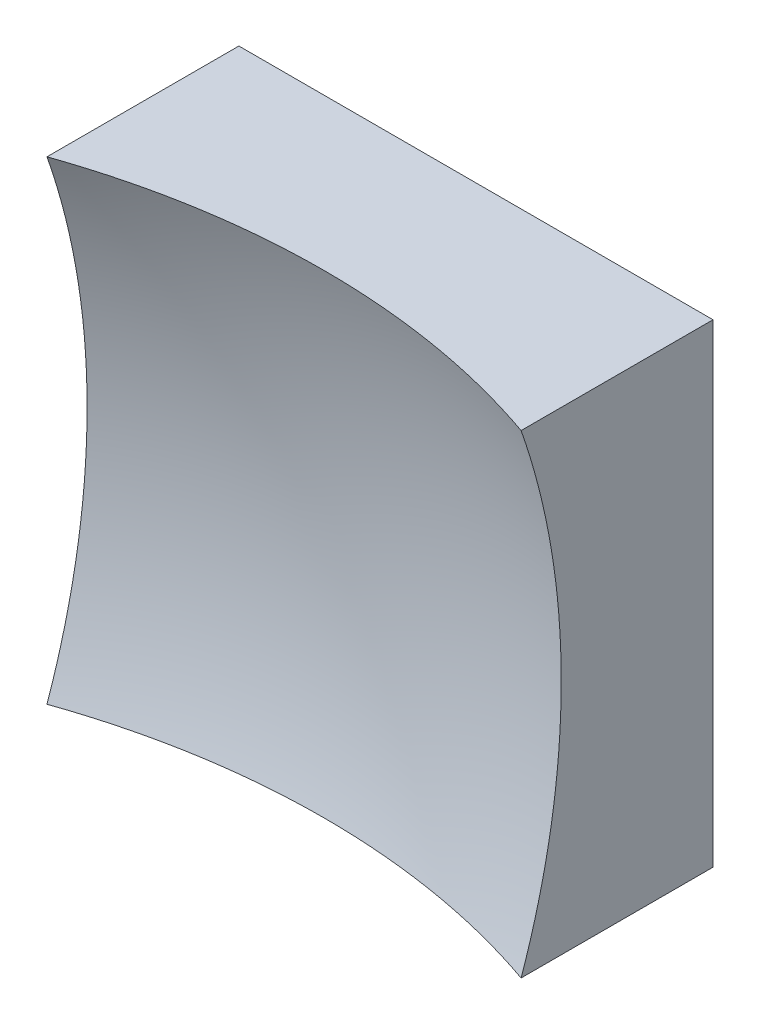
ISO-10303-21;
HEADER;
FILE_DESCRIPTION(('STEP AP214'),'2;1');
FILE_NAME('part.step','',(''),(''),'','','');
FILE_SCHEMA(('AUTOMOTIVE_DESIGN { 1 0 10303 214 1 1 1 1 }'));
ENDSEC;
DATA;
#1=APPLICATION_CONTEXT('core data for automotive mechanical design processes');
#2=APPLICATION_PROTOCOL_DEFINITION('international standard','automotive_design',2000,#1);
#3=PRODUCT_CONTEXT('',#1,'mechanical');
#4=PRODUCT('Part','Part','',(#3));
#5=PRODUCT_RELATED_PRODUCT_CATEGORY('part','',(#4));
#6=PRODUCT_DEFINITION_FORMATION('','',#4);
#7=PRODUCT_DEFINITION_CONTEXT('part definition',#1,'design');
#8=PRODUCT_DEFINITION('design','',#6,#7);
#9=PRODUCT_DEFINITION_SHAPE('','',#8);
#10=(LENGTH_UNIT() NAMED_UNIT(*) SI_UNIT(.MILLI.,.METRE.));
#11=(NAMED_UNIT(*) PLANE_ANGLE_UNIT() SI_UNIT($,.RADIAN.));
#12=(NAMED_UNIT(*) SI_UNIT($,.STERADIAN.) SOLID_ANGLE_UNIT());
#13=UNCERTAINTY_MEASURE_WITH_UNIT(LENGTH_MEASURE(1.E-05),#10,'distance_accuracy_value','');
#14=(GEOMETRIC_REPRESENTATION_CONTEXT(3) GLOBAL_UNCERTAINTY_ASSIGNED_CONTEXT((#13)) GLOBAL_UNIT_ASSIGNED_CONTEXT((#10,
#11,#12)) REPRESENTATION_CONTEXT('',''));
#15=CARTESIAN_POINT('',(0.,0.,0.));
#16=DIRECTION('',(0.,0.,1.));
#17=DIRECTION('',(1.,0.,0.));
#18=AXIS2_PLACEMENT_3D('',#15,#16,#17);
#19=CARTESIAN_POINT('',(-12.5,12.5,20.));
#20=DIRECTION('',(0.,1.,0.));
#21=DIRECTION('',(0.,0.,1.));
#22=AXIS2_PLACEMENT_3D('',#19,#20,#21);
#23=PLANE('',#22);
#24=CARTESIAN_POINT('',(0.,12.5,46.));
#25=DIRECTION('',(0.,1.,0.));
#26=DIRECTION('',(0.,0.,1.));
#27=AXIS2_PLACEMENT_3D('',#24,#25,#26);
#28=CIRCLE('',#27,37.9967103839267);
#29=CARTESIAN_POINT('',(12.5,12.5,10.1182497639817));
#30=VERTEX_POINT('',#29);
#31=CARTESIAN_POINT('',(-12.5,12.5,10.1182497639817));
#32=VERTEX_POINT('',#31);
#33=EDGE_CURVE('E83',#30,#32,#28,.T.);
#34=ORIENTED_EDGE('',*,*,#33,.F.);
#35=DIRECTION('',(0.,0.,-1.));
#36=VECTOR('',#35,1.);
#37=CARTESIAN_POINT('',(12.5,12.5,20.));
#38=LINE('',#37,#36);
#39=CARTESIAN_POINT('',(12.5,12.5,0.));
#40=VERTEX_POINT('',#39);
#41=EDGE_CURVE('E89',#30,#40,#38,.T.);
#42=ORIENTED_EDGE('',*,*,#41,.T.);
#43=DIRECTION('',(1.,0.,0.));
#44=VECTOR('',#43,1.);
#45=CARTESIAN_POINT('',(-12.5,12.5,0.));
#46=LINE('',#45,#44);
#47=CARTESIAN_POINT('',(-12.5,12.5,0.));
#48=VERTEX_POINT('',#47);
#49=EDGE_CURVE('E92',#48,#40,#46,.T.);
#50=ORIENTED_EDGE('',*,*,#49,.F.);
#51=DIRECTION('',(0.,0.,-1.));
#52=VECTOR('',#51,1.);
#53=CARTESIAN_POINT('',(-12.5,12.5,20.));
#54=LINE('',#53,#52);
#55=EDGE_CURVE('E51',#32,#48,#54,.T.);
#56=ORIENTED_EDGE('',*,*,#55,.F.);
#57=EDGE_LOOP('',(#34,#42,#50,#56));
#58=FACE_BOUND('',#57,.T.);
#59=ADVANCED_FACE('F43',(#58),#23,.T.);
#60=CARTESIAN_POINT('',(-12.5,12.5,20.));
#61=DIRECTION('',(1.,0.,0.));
#62=DIRECTION('',(0.,1.,0.));
#63=AXIS2_PLACEMENT_3D('',#60,#61,#62);
#64=PLANE('',#63);
#65=DIRECTION('',(0.,0.,-1.));
#66=VECTOR('',#65,1.);
#67=CARTESIAN_POINT('',(-12.5,-12.5,20.));
#68=LINE('',#67,#66);
#69=CARTESIAN_POINT('',(-12.5,-12.5,10.1182497639817));
#70=VERTEX_POINT('',#69);
#71=CARTESIAN_POINT('',(-12.5,-12.5,0.));
#72=VERTEX_POINT('',#71);
#73=EDGE_CURVE('E104',#70,#72,#68,.T.);
#74=ORIENTED_EDGE('',*,*,#73,.F.);
#75=CARTESIAN_POINT('',(-12.5,0.,46.));
#76=DIRECTION('',(1.,0.,0.));
#77=DIRECTION('',(0.,1.,0.));
#78=AXIS2_PLACEMENT_3D('',#75,#76,#77);
#79=CIRCLE('',#78,37.9967103839267);
#80=EDGE_CURVE('E93',#70,#32,#79,.T.);
#81=ORIENTED_EDGE('',*,*,#80,.T.);
#82=ORIENTED_EDGE('',*,*,#55,.T.);
#83=DIRECTION('',(0.,-1.,0.));
#84=VECTOR('',#83,1.);
#85=CARTESIAN_POINT('',(-12.5,12.5,0.));
#86=LINE('',#85,#84);
#87=EDGE_CURVE('E101',#48,#72,#86,.T.);
#88=ORIENTED_EDGE('',*,*,#87,.T.);
#89=EDGE_LOOP('',(#74,#81,#82,#88));
#90=FACE_BOUND('',#89,.T.);
#91=ADVANCED_FACE('F126',(#90),#64,.F.);
#92=CARTESIAN_POINT('',(-12.5,-12.5,20.));
#93=DIRECTION('',(0.,1.,0.));
#94=DIRECTION('',(0.,0.,1.));
#95=AXIS2_PLACEMENT_3D('',#92,#93,#94);
#96=PLANE('',#95);
#97=DIRECTION('',(0.,0.,-1.));
#98=VECTOR('',#97,1.);
#99=CARTESIAN_POINT('',(12.5,-12.5,20.));
#100=LINE('',#99,#98);
#101=CARTESIAN_POINT('',(12.5,-12.5,10.1182497639817));
#102=VERTEX_POINT('',#101);
#103=CARTESIAN_POINT('',(12.5,-12.5,0.));
#104=VERTEX_POINT('',#103);
#105=EDGE_CURVE('E100',#102,#104,#100,.T.);
#106=ORIENTED_EDGE('',*,*,#105,.F.);
#107=CARTESIAN_POINT('',(0.,-12.5,46.));
#108=DIRECTION('',(0.,1.,0.));
#109=DIRECTION('',(0.,0.,1.));
#110=AXIS2_PLACEMENT_3D('',#107,#108,#109);
#111=CIRCLE('',#110,37.9967103839267);
#112=EDGE_CURVE('E57',#102,#70,#111,.T.);
#113=ORIENTED_EDGE('',*,*,#112,.T.);
#114=ORIENTED_EDGE('',*,*,#73,.T.);
#115=DIRECTION('',(1.,0.,0.));
#116=VECTOR('',#115,1.);
#117=CARTESIAN_POINT('',(-12.5,-12.5,0.));
#118=LINE('',#117,#116);
#119=EDGE_CURVE('E106',#72,#104,#118,.T.);
#120=ORIENTED_EDGE('',*,*,#119,.T.);
#121=EDGE_LOOP('',(#106,#113,#114,#120));
#122=FACE_BOUND('',#121,.T.);
#123=ADVANCED_FACE('F125',(#122),#96,.F.);
#124=CARTESIAN_POINT('',(12.5,12.5,20.));
#125=DIRECTION('',(1.,0.,0.));
#126=DIRECTION('',(0.,1.,0.));
#127=AXIS2_PLACEMENT_3D('',#124,#125,#126);
#128=PLANE('',#127);
#129=CARTESIAN_POINT('',(12.5,0.,46.));
#130=DIRECTION('',(1.,0.,0.));
#131=DIRECTION('',(0.,1.,0.));
#132=AXIS2_PLACEMENT_3D('',#129,#130,#131);
#133=CIRCLE('',#132,37.9967103839267);
#134=EDGE_CURVE('E11',#102,#30,#133,.T.);
#135=ORIENTED_EDGE('',*,*,#134,.F.);
#136=ORIENTED_EDGE('',*,*,#105,.T.);
#137=DIRECTION('',(0.,-1.,0.));
#138=VECTOR('',#137,1.);
#139=CARTESIAN_POINT('',(12.5,12.5,0.));
#140=LINE('',#139,#138);
#141=EDGE_CURVE('E97',#40,#104,#140,.T.);
#142=ORIENTED_EDGE('',*,*,#141,.F.);
#143=ORIENTED_EDGE('',*,*,#41,.F.);
#144=EDGE_LOOP('',(#135,#136,#142,#143));
#145=FACE_BOUND('',#144,.T.);
#146=ADVANCED_FACE('F95',(#145),#128,.T.);
#147=CARTESIAN_POINT('',(0.,0.,0.));
#148=DIRECTION('',(0.,0.,-1.));
#149=DIRECTION('',(-1.,0.,0.));
#150=AXIS2_PLACEMENT_3D('',#147,#148,#149);
#151=PLANE('',#150);
#152=ORIENTED_EDGE('',*,*,#49,.T.);
#153=ORIENTED_EDGE('',*,*,#141,.T.);
#154=ORIENTED_EDGE('',*,*,#119,.F.);
#155=ORIENTED_EDGE('',*,*,#87,.F.);
#156=EDGE_LOOP('',(#152,#153,#154,#155));
#157=FACE_BOUND('',#156,.T.);
#158=ADVANCED_FACE('F129',(#157),#151,.T.);
#159=CARTESIAN_POINT('',(0.,0.,46.));
#160=DIRECTION('',(0.,0.,1.));
#161=DIRECTION('',(1.,0.,0.));
#162=AXIS2_PLACEMENT_3D('',#159,#160,#161);
#163=SPHERICAL_SURFACE('',#162,40.);
#164=ORIENTED_EDGE('',*,*,#33,.T.);
#165=ORIENTED_EDGE('',*,*,#80,.F.);
#166=ORIENTED_EDGE('',*,*,#112,.F.);
#167=ORIENTED_EDGE('',*,*,#134,.T.);
#168=EDGE_LOOP('',(#164,#165,#166,#167));
#169=FACE_BOUND('',#168,.T.);
#170=ADVANCED_FACE('F82',(#169),#163,.F.);
#171=CLOSED_SHELL('',(#59,#91,#123,#146,#158,#170));
#172=MANIFOLD_SOLID_BREP('B2',#171);
#173=ADVANCED_BREP_SHAPE_REPRESENTATION('',(#18,#172),#14);
#174=SHAPE_DEFINITION_REPRESENTATION(#9,#173);
ENDSEC;
END-ISO-10303-21;
